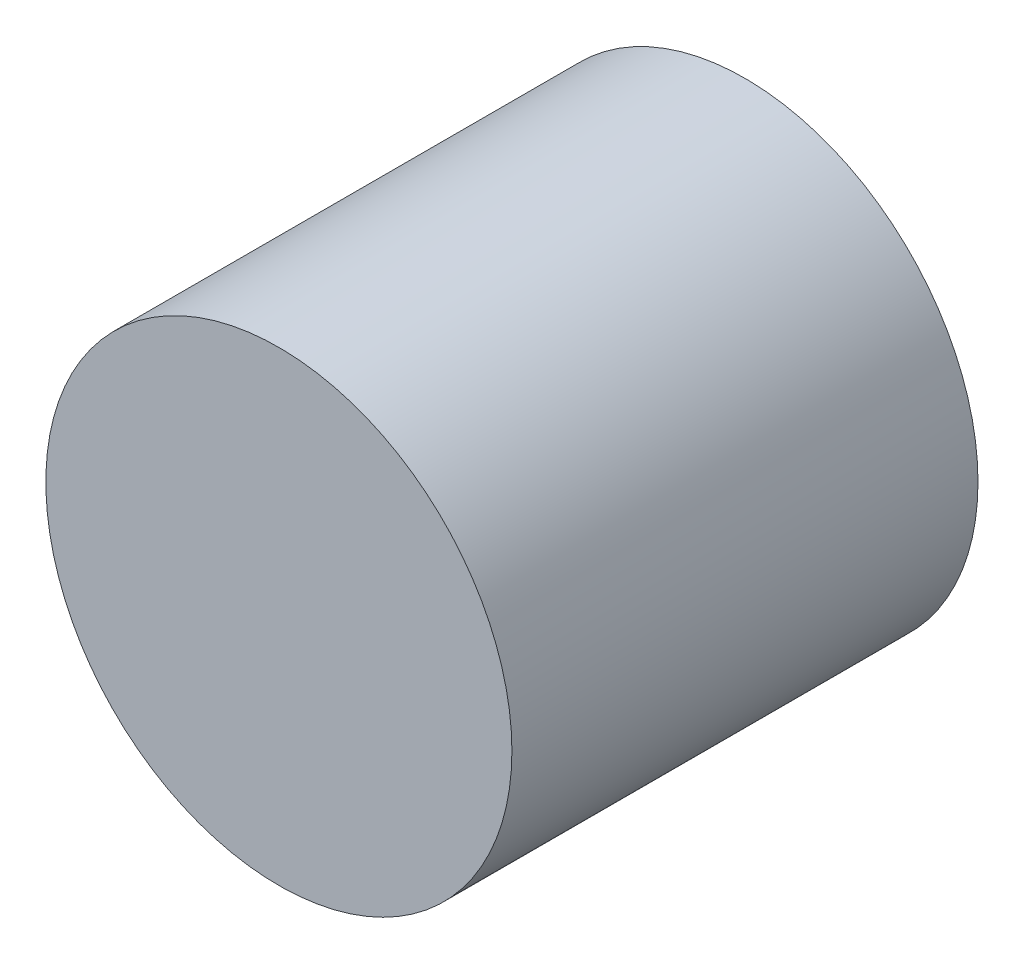
ISO-10303-21;
HEADER;
FILE_DESCRIPTION(('STEP AP214'),'2;1');
FILE_NAME('part.step','',(''),(''),'','','');
FILE_SCHEMA(('AUTOMOTIVE_DESIGN { 1 0 10303 214 1 1 1 1 }'));
ENDSEC;
DATA;
#1=APPLICATION_CONTEXT('core data for automotive mechanical design processes');
#2=APPLICATION_PROTOCOL_DEFINITION('international standard','automotive_design',2000,#1);
#3=PRODUCT_CONTEXT('',#1,'mechanical');
#4=PRODUCT('Part','Part','',(#3));
#5=PRODUCT_RELATED_PRODUCT_CATEGORY('part','',(#4));
#6=PRODUCT_DEFINITION_FORMATION('','',#4);
#7=PRODUCT_DEFINITION_CONTEXT('part definition',#1,'design');
#8=PRODUCT_DEFINITION('design','',#6,#7);
#9=PRODUCT_DEFINITION_SHAPE('','',#8);
#10=(LENGTH_UNIT() NAMED_UNIT(*) SI_UNIT(.MILLI.,.METRE.));
#11=(NAMED_UNIT(*) PLANE_ANGLE_UNIT() SI_UNIT($,.RADIAN.));
#12=(NAMED_UNIT(*) SI_UNIT($,.STERADIAN.) SOLID_ANGLE_UNIT());
#13=UNCERTAINTY_MEASURE_WITH_UNIT(LENGTH_MEASURE(1.E-05),#10,'distance_accuracy_value','');
#14=(GEOMETRIC_REPRESENTATION_CONTEXT(3) GLOBAL_UNCERTAINTY_ASSIGNED_CONTEXT((#13)) GLOBAL_UNIT_ASSIGNED_CONTEXT((#10,
#11,#12)) REPRESENTATION_CONTEXT('',''));
#15=CARTESIAN_POINT('',(0.,0.,0.));
#16=DIRECTION('',(0.,0.,1.));
#17=DIRECTION('',(1.,0.,0.));
#18=AXIS2_PLACEMENT_3D('',#15,#16,#17);
#19=CARTESIAN_POINT('',(0.,0.,58.));
#20=DIRECTION('',(0.,0.,-1.));
#21=DIRECTION('',(-1.,0.,0.));
#22=AXIS2_PLACEMENT_3D('',#19,#20,#21);
#23=CYLINDRICAL_SURFACE('',#22,29.);
#24=CARTESIAN_POINT('',(0.,0.,58.));
#25=DIRECTION('',(0.,0.,1.));
#26=DIRECTION('',(1.,0.,0.));
#27=AXIS2_PLACEMENT_3D('',#24,#25,#26);
#28=CIRCLE('',#27,29.);
#29=CARTESIAN_POINT('',(29.,0.,58.));
#30=VERTEX_POINT('',#29);
#31=EDGE_CURVE('E10',#30,#30,#28,.T.);
#32=ORIENTED_EDGE('',*,*,#31,.F.);
#33=EDGE_LOOP('',(#32));
#34=FACE_BOUND('',#33,.T.);
#35=CARTESIAN_POINT('',(0.,0.,0.));
#36=DIRECTION('',(0.,0.,1.));
#37=DIRECTION('',(1.,0.,0.));
#38=AXIS2_PLACEMENT_3D('',#35,#36,#37);
#39=CIRCLE('',#38,29.);
#40=CARTESIAN_POINT('',(29.,0.,0.));
#41=VERTEX_POINT('',#40);
#42=EDGE_CURVE('E34',#41,#41,#39,.T.);
#43=ORIENTED_EDGE('',*,*,#42,.T.);
#44=EDGE_LOOP('',(#43));
#45=FACE_BOUND('',#44,.T.);
#46=ADVANCED_FACE('F31',(#34,#45),#23,.T.);
#47=CARTESIAN_POINT('',(0.,0.,58.));
#48=DIRECTION('',(0.,0.,1.));
#49=DIRECTION('',(1.,0.,0.));
#50=AXIS2_PLACEMENT_3D('',#47,#48,#49);
#51=PLANE('',#50);
#52=ORIENTED_EDGE('',*,*,#31,.T.);
#53=EDGE_LOOP('',(#52));
#54=FACE_BOUND('',#53,.T.);
#55=ADVANCED_FACE('F46',(#54),#51,.T.);
#56=CARTESIAN_POINT('',(0.,0.,0.));
#57=DIRECTION('',(0.,0.,1.));
#58=DIRECTION('',(1.,0.,0.));
#59=AXIS2_PLACEMENT_3D('',#56,#57,#58);
#60=PLANE('',#59);
#61=ORIENTED_EDGE('',*,*,#42,.F.);
#62=EDGE_LOOP('',(#61));
#63=FACE_BOUND('',#62,.T.);
#64=ADVANCED_FACE('F44',(#63),#60,.F.);
#65=CLOSED_SHELL('',(#46,#55,#64));
#66=MANIFOLD_SOLID_BREP('B2',#65);
#67=ADVANCED_BREP_SHAPE_REPRESENTATION('',(#18,#66),#14);
#68=SHAPE_DEFINITION_REPRESENTATION(#9,#67);
ENDSEC;
END-ISO-10303-21;
